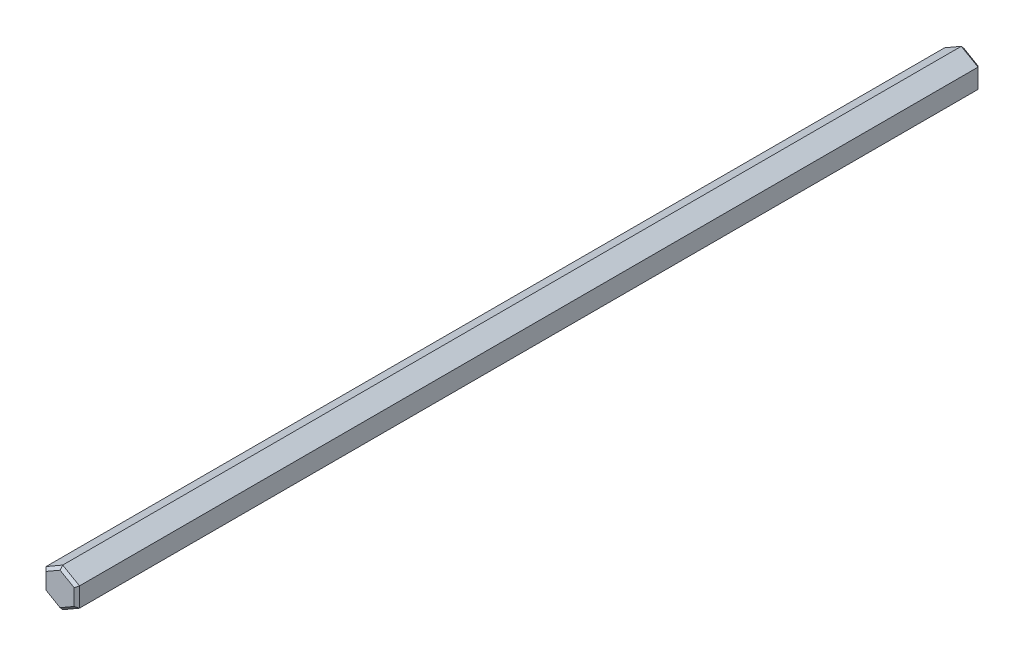
ISO-10303-21;
HEADER;
FILE_DESCRIPTION(('STEP AP214'),'2;1');
FILE_NAME('part.step','',(''),(''),'','','');
FILE_SCHEMA(('AUTOMOTIVE_DESIGN { 1 0 10303 214 1 1 1 1 }'));
ENDSEC;
DATA;
#1=APPLICATION_CONTEXT('core data for automotive mechanical design processes');
#2=APPLICATION_PROTOCOL_DEFINITION('international standard','automotive_design',2000,#1);
#3=PRODUCT_CONTEXT('',#1,'mechanical');
#4=PRODUCT('Part','Part','',(#3));
#5=PRODUCT_RELATED_PRODUCT_CATEGORY('part','',(#4));
#6=PRODUCT_DEFINITION_FORMATION('','',#4);
#7=PRODUCT_DEFINITION_CONTEXT('part definition',#1,'design');
#8=PRODUCT_DEFINITION('design','',#6,#7);
#9=PRODUCT_DEFINITION_SHAPE('','',#8);
#10=(LENGTH_UNIT() NAMED_UNIT(*) SI_UNIT(.MILLI.,.METRE.));
#11=(NAMED_UNIT(*) PLANE_ANGLE_UNIT() SI_UNIT($,.RADIAN.));
#12=(NAMED_UNIT(*) SI_UNIT($,.STERADIAN.) SOLID_ANGLE_UNIT());
#13=UNCERTAINTY_MEASURE_WITH_UNIT(LENGTH_MEASURE(1.E-05),#10,'distance_accuracy_value','');
#14=(GEOMETRIC_REPRESENTATION_CONTEXT(3) GLOBAL_UNCERTAINTY_ASSIGNED_CONTEXT((#13)) GLOBAL_UNIT_ASSIGNED_CONTEXT((#10,
#11,#12)) REPRESENTATION_CONTEXT('',''));
#15=CARTESIAN_POINT('',(0.,0.,0.));
#16=DIRECTION('',(0.,0.,1.));
#17=DIRECTION('',(1.,0.,0.));
#18=AXIS2_PLACEMENT_3D('',#15,#16,#17);
#19=CARTESIAN_POINT('',(-1.775,-1.63101451046069,67.3));
#20=DIRECTION('',(-0.353553390593274,-0.612372435695795,0.707106781186547));
#21=DIRECTION('',(0.,-0.755928946018454,-0.654653670707978));
#22=AXIS2_PLACEMENT_3D('',#19,#20,#21);
#23=PLANE('',#22);
#24=DIRECTION('',(0.866025403784438,-0.5,0.));
#25=VECTOR('',#24,1.);
#26=CARTESIAN_POINT('',(-2.1,-1.21243556529822,67.5));
#27=LINE('',#26,#25);
#28=CARTESIAN_POINT('',(-2.10000000000001,-1.21243556529822,67.5));
#29=VERTEX_POINT('',#28);
#30=CARTESIAN_POINT('',(0.,-2.42487113059644,67.5));
#31=VERTEX_POINT('',#30);
#32=EDGE_CURVE('E120',#29,#31,#27,.T.);
#33=ORIENTED_EDGE('',*,*,#32,.F.);
#34=DIRECTION('',(0.654653670707977,0.37796447300923,0.654653670707976));
#35=VECTOR('',#34,1.);
#36=CARTESIAN_POINT('',(-2.5,-1.44337567297407,67.1));
#37=LINE('',#36,#35);
#38=CARTESIAN_POINT('',(-2.5,-1.44337567297407,67.1));
#39=VERTEX_POINT('',#38);
#40=EDGE_CURVE('E108',#39,#29,#37,.T.);
#41=ORIENTED_EDGE('',*,*,#40,.F.);
#42=DIRECTION('',(0.866025403784439,-0.5,0.));
#43=VECTOR('',#42,1.);
#44=CARTESIAN_POINT('',(-2.5,-1.44337567297406,67.1));
#45=LINE('',#44,#43);
#46=CARTESIAN_POINT('',(0.,-2.88675134594812,67.1));
#47=VERTEX_POINT('',#46);
#48=EDGE_CURVE('E131',#47,#39,#45,.F.);
#49=ORIENTED_EDGE('',*,*,#48,.F.);
#50=DIRECTION('',(0.,-0.755928946018454,-0.654653670707978));
#51=VECTOR('',#50,1.);
#52=CARTESIAN_POINT('',(0.,-2.48260615751539,67.45));
#53=LINE('',#52,#51);
#54=EDGE_CURVE('E20',#31,#47,#53,.T.);
#55=ORIENTED_EDGE('',*,*,#54,.F.);
#56=EDGE_LOOP('',(#33,#41,#49,#55));
#57=FACE_BOUND('',#56,.T.);
#58=ADVANCED_FACE('F17',(#57),#23,.T.);
#59=CARTESIAN_POINT('',(0.524999999999999,-2.35270234694773,67.3));
#60=DIRECTION('',(0.353553390593274,-0.612372435695795,0.707106781186547));
#61=DIRECTION('',(0.,-0.755928946018454,-0.654653670707978));
#62=AXIS2_PLACEMENT_3D('',#59,#60,#61);
#63=PLANE('',#62);
#64=DIRECTION('',(0.866025403784439,0.5,0.));
#65=VECTOR('',#64,1.);
#66=CARTESIAN_POINT('',(0.,-2.88675134594813,67.1));
#67=LINE('',#66,#65);
#68=CARTESIAN_POINT('',(2.5,-1.44337567297407,67.1));
#69=VERTEX_POINT('',#68);
#70=EDGE_CURVE('E146',#69,#47,#67,.F.);
#71=ORIENTED_EDGE('',*,*,#70,.F.);
#72=DIRECTION('',(0.654653670707976,-0.377964473009231,-0.654653670707976));
#73=VECTOR('',#72,1.);
#74=CARTESIAN_POINT('',(2.10000000000001,-1.21243556529822,67.5));
#75=LINE('',#74,#73);
#76=CARTESIAN_POINT('',(2.1,-1.21243556529822,67.5));
#77=VERTEX_POINT('',#76);
#78=EDGE_CURVE('E163',#77,#69,#75,.T.);
#79=ORIENTED_EDGE('',*,*,#78,.F.);
#80=DIRECTION('',(0.866025403784439,0.5,0.));
#81=VECTOR('',#80,1.);
#82=CARTESIAN_POINT('',(0.,-2.42487113059643,67.5));
#83=LINE('',#82,#81);
#84=EDGE_CURVE('E122',#31,#77,#83,.T.);
#85=ORIENTED_EDGE('',*,*,#84,.F.);
#86=ORIENTED_EDGE('',*,*,#54,.T.);
#87=EDGE_LOOP('',(#71,#79,#85,#86));
#88=FACE_BOUND('',#87,.T.);
#89=ADVANCED_FACE('F143',(#88),#63,.T.);
#90=CARTESIAN_POINT('',(-1.775,-1.63101451046069,-67.3));
#91=DIRECTION('',(-0.353553390593274,-0.612372435695795,-0.707106781186547));
#92=DIRECTION('',(0.,0.755928946018454,-0.654653670707978));
#93=AXIS2_PLACEMENT_3D('',#90,#91,#92);
#94=PLANE('',#93);
#95=DIRECTION('',(0.866025403784439,-0.5,0.));
#96=VECTOR('',#95,1.);
#97=CARTESIAN_POINT('',(-2.1,-1.21243556529822,-67.5));
#98=LINE('',#97,#96);
#99=CARTESIAN_POINT('',(-2.10000000000001,-1.21243556529822,-67.5));
#100=VERTEX_POINT('',#99);
#101=CARTESIAN_POINT('',(0.,-2.42487113059644,-67.5));
#102=VERTEX_POINT('',#101);
#103=EDGE_CURVE('E208',#100,#102,#98,.T.);
#104=ORIENTED_EDGE('',*,*,#103,.T.);
#105=DIRECTION('',(0.,0.755928946018454,-0.654653670707978));
#106=VECTOR('',#105,1.);
#107=CARTESIAN_POINT('',(0.,-2.48260615751539,-67.45));
#108=LINE('',#107,#106);
#109=CARTESIAN_POINT('',(0.,-2.88675134594812,-67.1));
#110=VERTEX_POINT('',#109);
#111=EDGE_CURVE('E117',#110,#102,#108,.T.);
#112=ORIENTED_EDGE('',*,*,#111,.F.);
#113=DIRECTION('',(0.866025403784439,-0.5,0.));
#114=VECTOR('',#113,1.);
#115=CARTESIAN_POINT('',(-2.5,-1.44337567297406,-67.1));
#116=LINE('',#115,#114);
#117=CARTESIAN_POINT('',(-2.5,-1.44337567297407,-67.1));
#118=VERTEX_POINT('',#117);
#119=EDGE_CURVE('E128',#118,#110,#116,.T.);
#120=ORIENTED_EDGE('',*,*,#119,.F.);
#121=DIRECTION('',(-0.654653670707977,-0.37796447300923,0.654653670707976));
#122=VECTOR('',#121,1.);
#123=CARTESIAN_POINT('',(-2.10000000000001,-1.21243556529822,-67.5));
#124=LINE('',#123,#122);
#125=EDGE_CURVE('E116',#100,#118,#124,.T.);
#126=ORIENTED_EDGE('',*,*,#125,.F.);
#127=EDGE_LOOP('',(#104,#112,#120,#126));
#128=FACE_BOUND('',#127,.T.);
#129=ADVANCED_FACE('F270',(#128),#94,.T.);
#130=CARTESIAN_POINT('',(0.524999999999999,-2.35270234694773,-67.3));
#131=DIRECTION('',(0.353553390593274,-0.612372435695795,-0.707106781186547));
#132=DIRECTION('',(0.,0.755928946018454,-0.654653670707978));
#133=AXIS2_PLACEMENT_3D('',#130,#131,#132);
#134=PLANE('',#133);
#135=DIRECTION('',(0.866025403784439,0.5,0.));
#136=VECTOR('',#135,1.);
#137=CARTESIAN_POINT('',(0.,-2.42487113059643,-67.5));
#138=LINE('',#137,#136);
#139=CARTESIAN_POINT('',(2.1,-1.21243556529822,-67.5));
#140=VERTEX_POINT('',#139);
#141=EDGE_CURVE('E206',#102,#140,#138,.T.);
#142=ORIENTED_EDGE('',*,*,#141,.T.);
#143=DIRECTION('',(-0.654653670707976,0.377964473009241,-0.65465367070797));
#144=VECTOR('',#143,1.);
#145=CARTESIAN_POINT('',(2.49999999999999,-1.44337567297407,-67.1));
#146=LINE('',#145,#144);
#147=CARTESIAN_POINT('',(2.5,-1.44337567297406,-67.1));
#148=VERTEX_POINT('',#147);
#149=EDGE_CURVE('E215',#148,#140,#146,.T.);
#150=ORIENTED_EDGE('',*,*,#149,.F.);
#151=DIRECTION('',(0.866025403784439,0.5,0.));
#152=VECTOR('',#151,1.);
#153=CARTESIAN_POINT('',(0.,-2.88675134594813,-67.1));
#154=LINE('',#153,#152);
#155=EDGE_CURVE('E156',#110,#148,#154,.T.);
#156=ORIENTED_EDGE('',*,*,#155,.F.);
#157=ORIENTED_EDGE('',*,*,#111,.T.);
#158=EDGE_LOOP('',(#142,#150,#156,#157));
#159=FACE_BOUND('',#158,.T.);
#160=ADVANCED_FACE('F272',(#159),#134,.T.);
#161=CARTESIAN_POINT('',(-2.3,0.721687836487032,67.3));
#162=DIRECTION('',(-0.707106781186548,0.,0.707106781186547));
#163=DIRECTION('',(0.707106781186547,0.,0.707106781186548));
#164=AXIS2_PLACEMENT_3D('',#161,#162,#163);
#165=PLANE('',#164);
#166=DIRECTION('',(0.,1.,0.));
#167=VECTOR('',#166,1.);
#168=CARTESIAN_POINT('',(-2.1,0.,67.5));
#169=LINE('',#168,#167);
#170=CARTESIAN_POINT('',(-2.10000000000001,1.21243556529822,67.5));
#171=VERTEX_POINT('',#170);
#172=EDGE_CURVE('E111',#171,#29,#169,.F.);
#173=ORIENTED_EDGE('',*,*,#172,.F.);
#174=DIRECTION('',(0.65465367070798,-0.377964473009224,0.654653670707976));
#175=VECTOR('',#174,1.);
#176=CARTESIAN_POINT('',(-2.50000000000001,1.44337567297407,67.1));
#177=LINE('',#176,#175);
#178=CARTESIAN_POINT('',(-2.5,1.44337567297407,67.1));
#179=VERTEX_POINT('',#178);
#180=EDGE_CURVE('E201',#179,#171,#177,.T.);
#181=ORIENTED_EDGE('',*,*,#180,.F.);
#182=DIRECTION('',(0.,1.,0.));
#183=VECTOR('',#182,1.);
#184=CARTESIAN_POINT('',(-2.5,1.44337567297406,67.1));
#185=LINE('',#184,#183);
#186=EDGE_CURVE('E114',#39,#179,#185,.T.);
#187=ORIENTED_EDGE('',*,*,#186,.F.);
#188=ORIENTED_EDGE('',*,*,#40,.T.);
#189=EDGE_LOOP('',(#173,#181,#187,#188));
#190=FACE_BOUND('',#189,.T.);
#191=ADVANCED_FACE('F109',(#190),#165,.T.);
#192=CARTESIAN_POINT('',(-2.3,0.721687836487032,-67.3));
#193=DIRECTION('',(-0.707106781186548,0.,-0.707106781186547));
#194=DIRECTION('',(-0.707106781186547,0.,0.707106781186548));
#195=AXIS2_PLACEMENT_3D('',#192,#193,#194);
#196=PLANE('',#195);
#197=DIRECTION('',(0.,1.,0.));
#198=VECTOR('',#197,1.);
#199=CARTESIAN_POINT('',(-2.1,0.,-67.5));
#200=LINE('',#199,#198);
#201=CARTESIAN_POINT('',(-2.1,1.21243556529822,-67.5));
#202=VERTEX_POINT('',#201);
#203=EDGE_CURVE('E210',#202,#100,#200,.F.);
#204=ORIENTED_EDGE('',*,*,#203,.T.);
#205=ORIENTED_EDGE('',*,*,#125,.T.);
#206=DIRECTION('',(0.,1.,0.));
#207=VECTOR('',#206,1.);
#208=CARTESIAN_POINT('',(-2.5,1.44337567297406,-67.1));
#209=LINE('',#208,#207);
#210=CARTESIAN_POINT('',(-2.5,1.44337567297407,-67.1));
#211=VERTEX_POINT('',#210);
#212=EDGE_CURVE('E191',#211,#118,#209,.F.);
#213=ORIENTED_EDGE('',*,*,#212,.F.);
#214=DIRECTION('',(-0.654653670707989,0.37796447300922,0.65465367070797));
#215=VECTOR('',#214,1.);
#216=CARTESIAN_POINT('',(-2.10000000000001,1.21243556529822,-67.5));
#217=LINE('',#216,#215);
#218=EDGE_CURVE('E195',#202,#211,#217,.T.);
#219=ORIENTED_EDGE('',*,*,#218,.F.);
#220=EDGE_LOOP('',(#204,#205,#213,#219));
#221=FACE_BOUND('',#220,.T.);
#222=ADVANCED_FACE('F264',(#221),#196,.T.);
#223=CARTESIAN_POINT('',(-2.5,-1.44337567297406,0.));
#224=DIRECTION('',(-0.5,-0.866025403784439,0.));
#225=DIRECTION('',(0.866025403784439,-0.5,0.));
#226=AXIS2_PLACEMENT_3D('',#223,#224,#225);
#227=PLANE('',#226);
#228=ORIENTED_EDGE('',*,*,#119,.T.);
#229=DIRECTION('',(0.,0.,1.));
#230=VECTOR('',#229,1.);
#231=CARTESIAN_POINT('',(0.,-2.88675134594813,0.));
#232=LINE('',#231,#230);
#233=EDGE_CURVE('E150',#47,#110,#232,.F.);
#234=ORIENTED_EDGE('',*,*,#233,.F.);
#235=ORIENTED_EDGE('',*,*,#48,.T.);
#236=DIRECTION('',(0.,0.,1.));
#237=VECTOR('',#236,1.);
#238=CARTESIAN_POINT('',(-2.5,-1.44337567297407,0.));
#239=LINE('',#238,#237);
#240=EDGE_CURVE('E186',#118,#39,#239,.T.);
#241=ORIENTED_EDGE('',*,*,#240,.F.);
#242=EDGE_LOOP('',(#228,#234,#235,#241));
#243=FACE_BOUND('',#242,.T.);
#244=ADVANCED_FACE('F151',(#243),#227,.T.);
#245=CARTESIAN_POINT('',(0.,0.,67.5));
#246=DIRECTION('',(0.,0.,1.));
#247=DIRECTION('',(1.,0.,0.));
#248=AXIS2_PLACEMENT_3D('',#245,#246,#247);
#249=PLANE('',#248);
#250=DIRECTION('',(0.,1.,0.));
#251=VECTOR('',#250,1.);
#252=CARTESIAN_POINT('',(2.10000000000001,-0.721687836487033,67.5));
#253=LINE('',#252,#251);
#254=CARTESIAN_POINT('',(2.1,1.21243556529822,67.5));
#255=VERTEX_POINT('',#254);
#256=EDGE_CURVE('E165',#255,#77,#253,.F.);
#257=ORIENTED_EDGE('',*,*,#256,.F.);
#258=DIRECTION('',(0.866025403784439,-0.5,0.));
#259=VECTOR('',#258,1.);
#260=CARTESIAN_POINT('',(0.,2.42487113059644,67.5));
#261=LINE('',#260,#259);
#262=CARTESIAN_POINT('',(0.,2.42487113059644,67.5));
#263=VERTEX_POINT('',#262);
#264=EDGE_CURVE('E180',#263,#255,#261,.T.);
#265=ORIENTED_EDGE('',*,*,#264,.F.);
#266=DIRECTION('',(0.866025403784439,0.5,0.));
#267=VECTOR('',#266,1.);
#268=CARTESIAN_POINT('',(-2.10000000000001,1.21243556529822,67.5));
#269=LINE('',#268,#267);
#270=EDGE_CURVE('E126',#171,#263,#269,.T.);
#271=ORIENTED_EDGE('',*,*,#270,.F.);
#272=ORIENTED_EDGE('',*,*,#172,.T.);
#273=ORIENTED_EDGE('',*,*,#32,.T.);
#274=ORIENTED_EDGE('',*,*,#84,.T.);
#275=EDGE_LOOP('',(#257,#265,#271,#272,#273,#274));
#276=FACE_BOUND('',#275,.T.);
#277=ADVANCED_FACE('F124',(#276),#249,.T.);
#278=CARTESIAN_POINT('',(2.3,-0.721687836487033,67.3));
#279=DIRECTION('',(0.707106781186548,0.,0.707106781186547));
#280=DIRECTION('',(0.707106781186547,0.,-0.707106781186548));
#281=AXIS2_PLACEMENT_3D('',#278,#279,#280);
#282=PLANE('',#281);
#283=DIRECTION('',(0.,1.,0.));
#284=VECTOR('',#283,1.);
#285=CARTESIAN_POINT('',(2.5,-1.44337567297406,67.1));
#286=LINE('',#285,#284);
#287=CARTESIAN_POINT('',(2.5,1.44337567297406,67.1));
#288=VERTEX_POINT('',#287);
#289=EDGE_CURVE('E176',#288,#69,#286,.F.);
#290=ORIENTED_EDGE('',*,*,#289,.F.);
#291=DIRECTION('',(0.654653670707981,0.377964473009224,-0.654653670707975));
#292=VECTOR('',#291,1.);
#293=CARTESIAN_POINT('',(2.1,1.21243556529822,67.5));
#294=LINE('',#293,#292);
#295=EDGE_CURVE('E174',#255,#288,#294,.T.);
#296=ORIENTED_EDGE('',*,*,#295,.F.);
#297=ORIENTED_EDGE('',*,*,#256,.T.);
#298=ORIENTED_EDGE('',*,*,#78,.T.);
#299=EDGE_LOOP('',(#290,#296,#297,#298));
#300=FACE_BOUND('',#299,.T.);
#301=ADVANCED_FACE('F172',(#300),#282,.T.);
#302=CARTESIAN_POINT('',(0.,-2.88675134594813,0.));
#303=DIRECTION('',(0.5,-0.866025403784439,0.));
#304=DIRECTION('',(0.866025403784439,0.5,0.));
#305=AXIS2_PLACEMENT_3D('',#302,#303,#304);
#306=PLANE('',#305);
#307=ORIENTED_EDGE('',*,*,#155,.T.);
#308=DIRECTION('',(0.,0.,-1.));
#309=VECTOR('',#308,1.);
#310=CARTESIAN_POINT('',(2.5,-1.44337567297407,0.));
#311=LINE('',#310,#309);
#312=EDGE_CURVE('E161',#69,#148,#311,.T.);
#313=ORIENTED_EDGE('',*,*,#312,.F.);
#314=ORIENTED_EDGE('',*,*,#70,.T.);
#315=ORIENTED_EDGE('',*,*,#233,.T.);
#316=EDGE_LOOP('',(#307,#313,#314,#315));
#317=FACE_BOUND('',#316,.T.);
#318=ADVANCED_FACE('F159',(#317),#306,.T.);
#319=CARTESIAN_POINT('',(2.3,-0.721687836487033,-67.3));
#320=DIRECTION('',(0.707106781186548,0.,-0.707106781186547));
#321=DIRECTION('',(-0.707106781186547,0.,-0.707106781186548));
#322=AXIS2_PLACEMENT_3D('',#319,#320,#321);
#323=PLANE('',#322);
#324=DIRECTION('',(0.,1.,0.));
#325=VECTOR('',#324,1.);
#326=CARTESIAN_POINT('',(2.1,0.,-67.5));
#327=LINE('',#326,#325);
#328=CARTESIAN_POINT('',(2.1,1.21243556529822,-67.5));
#329=VERTEX_POINT('',#328);
#330=EDGE_CURVE('E203',#140,#329,#327,.T.);
#331=ORIENTED_EDGE('',*,*,#330,.T.);
#332=DIRECTION('',(0.654653670707977,0.377964473009228,0.654653670707977));
#333=VECTOR('',#332,1.);
#334=CARTESIAN_POINT('',(2.10000000000001,1.21243556529821,-67.5));
#335=LINE('',#334,#333);
#336=CARTESIAN_POINT('',(2.5,1.44337567297406,-67.1));
#337=VERTEX_POINT('',#336);
#338=EDGE_CURVE('E213',#329,#337,#335,.T.);
#339=ORIENTED_EDGE('',*,*,#338,.T.);
#340=DIRECTION('',(0.,1.,0.));
#341=VECTOR('',#340,1.);
#342=CARTESIAN_POINT('',(2.5,-1.44337567297406,-67.1));
#343=LINE('',#342,#341);
#344=EDGE_CURVE('E220',#148,#337,#343,.T.);
#345=ORIENTED_EDGE('',*,*,#344,.F.);
#346=ORIENTED_EDGE('',*,*,#149,.T.);
#347=EDGE_LOOP('',(#331,#339,#345,#346));
#348=FACE_BOUND('',#347,.T.);
#349=ADVANCED_FACE('F221',(#348),#323,.T.);
#350=CARTESIAN_POINT('',(0.,0.,-67.5));
#351=DIRECTION('',(0.,0.,1.));
#352=DIRECTION('',(1.,0.,0.));
#353=AXIS2_PLACEMENT_3D('',#350,#351,#352);
#354=PLANE('',#353);
#355=DIRECTION('',(-0.866025403784439,0.5,0.));
#356=VECTOR('',#355,1.);
#357=CARTESIAN_POINT('',(2.10000000000001,1.21243556529822,-67.5));
#358=LINE('',#357,#356);
#359=CARTESIAN_POINT('',(0.,2.42487113059643,-67.5));
#360=VERTEX_POINT('',#359);
#361=EDGE_CURVE('E225',#329,#360,#358,.T.);
#362=ORIENTED_EDGE('',*,*,#361,.F.);
#363=ORIENTED_EDGE('',*,*,#330,.F.);
#364=ORIENTED_EDGE('',*,*,#141,.F.);
#365=ORIENTED_EDGE('',*,*,#103,.F.);
#366=ORIENTED_EDGE('',*,*,#203,.F.);
#367=DIRECTION('',(-0.866025403784439,-0.5,0.));
#368=VECTOR('',#367,1.);
#369=CARTESIAN_POINT('',(0.,2.42487113059643,-67.5));
#370=LINE('',#369,#368);
#371=EDGE_CURVE('E197',#360,#202,#370,.T.);
#372=ORIENTED_EDGE('',*,*,#371,.F.);
#373=EDGE_LOOP('',(#362,#363,#364,#365,#366,#372));
#374=FACE_BOUND('',#373,.T.);
#375=ADVANCED_FACE('F267',(#374),#354,.F.);
#376=CARTESIAN_POINT('',(-0.525000000000001,2.35270234694773,67.3));
#377=DIRECTION('',(-0.353553390593274,0.612372435695795,0.707106781186547));
#378=DIRECTION('',(0.,-0.755928946018454,0.654653670707978));
#379=AXIS2_PLACEMENT_3D('',#376,#377,#378);
#380=PLANE('',#379);
#381=ORIENTED_EDGE('',*,*,#270,.T.);
#382=DIRECTION('',(0.,-0.755928946018454,0.654653670707978));
#383=VECTOR('',#382,1.);
#384=CARTESIAN_POINT('',(0.,2.07021310809423,67.8071428571429));
#385=LINE('',#384,#383);
#386=CARTESIAN_POINT('',(0.,2.88675134594812,67.1));
#387=VERTEX_POINT('',#386);
#388=EDGE_CURVE('E184',#387,#263,#385,.T.);
#389=ORIENTED_EDGE('',*,*,#388,.F.);
#390=DIRECTION('',(-0.866025403784439,-0.5,0.));
#391=VECTOR('',#390,1.);
#392=CARTESIAN_POINT('',(0.,2.88675134594813,67.1));
#393=LINE('',#392,#391);
#394=EDGE_CURVE('E234',#179,#387,#393,.F.);
#395=ORIENTED_EDGE('',*,*,#394,.F.);
#396=ORIENTED_EDGE('',*,*,#180,.T.);
#397=EDGE_LOOP('',(#381,#389,#395,#396));
#398=FACE_BOUND('',#397,.T.);
#399=ADVANCED_FACE('F259',(#398),#380,.T.);
#400=CARTESIAN_POINT('',(-0.525000000000001,2.35270234694773,-67.3));
#401=DIRECTION('',(-0.353553390593274,0.612372435695795,-0.707106781186547));
#402=DIRECTION('',(0.,0.755928946018454,0.654653670707978));
#403=AXIS2_PLACEMENT_3D('',#400,#401,#402);
#404=PLANE('',#403);
#405=DIRECTION('',(-0.866025403784439,-0.5,0.));
#406=VECTOR('',#405,1.);
#407=CARTESIAN_POINT('',(0.,2.88675134594813,-67.1));
#408=LINE('',#407,#406);
#409=CARTESIAN_POINT('',(0.,2.88675134594812,-67.1));
#410=VERTEX_POINT('',#409);
#411=EDGE_CURVE('E35',#410,#211,#408,.T.);
#412=ORIENTED_EDGE('',*,*,#411,.F.);
#413=DIRECTION('',(0.,0.755928946018454,0.654653670707978));
#414=VECTOR('',#413,1.);
#415=CARTESIAN_POINT('',(0.,2.07021310809423,-67.8071428571429));
#416=LINE('',#415,#414);
#417=EDGE_CURVE('E232',#360,#410,#416,.T.);
#418=ORIENTED_EDGE('',*,*,#417,.F.);
#419=ORIENTED_EDGE('',*,*,#371,.T.);
#420=ORIENTED_EDGE('',*,*,#218,.T.);
#421=EDGE_LOOP('',(#412,#418,#419,#420));
#422=FACE_BOUND('',#421,.T.);
#423=ADVANCED_FACE('F265',(#422),#404,.T.);
#424=CARTESIAN_POINT('',(-2.5,1.44337567297406,0.));
#425=DIRECTION('',(-1.,0.,0.));
#426=DIRECTION('',(0.,0.,1.));
#427=AXIS2_PLACEMENT_3D('',#424,#425,#426);
#428=PLANE('',#427);
#429=ORIENTED_EDGE('',*,*,#212,.T.);
#430=ORIENTED_EDGE('',*,*,#240,.T.);
#431=ORIENTED_EDGE('',*,*,#186,.T.);
#432=DIRECTION('',(0.,0.,1.));
#433=VECTOR('',#432,1.);
#434=CARTESIAN_POINT('',(-2.5,1.44337567297406,0.));
#435=LINE('',#434,#433);
#436=EDGE_CURVE('E238',#211,#179,#435,.T.);
#437=ORIENTED_EDGE('',*,*,#436,.F.);
#438=EDGE_LOOP('',(#429,#430,#431,#437));
#439=FACE_BOUND('',#438,.T.);
#440=ADVANCED_FACE('F261',(#439),#428,.T.);
#441=CARTESIAN_POINT('',(1.775,1.63101451046069,67.3));
#442=DIRECTION('',(0.353553390593274,0.612372435695795,0.707106781186547));
#443=DIRECTION('',(0.,-0.755928946018454,0.654653670707978));
#444=AXIS2_PLACEMENT_3D('',#441,#442,#443);
#445=PLANE('',#444);
#446=ORIENTED_EDGE('',*,*,#264,.T.);
#447=ORIENTED_EDGE('',*,*,#295,.T.);
#448=DIRECTION('',(-0.866025403784439,0.5,0.));
#449=VECTOR('',#448,1.);
#450=CARTESIAN_POINT('',(2.5,1.44337567297406,67.1));
#451=LINE('',#450,#449);
#452=EDGE_CURVE('E241',#387,#288,#451,.F.);
#453=ORIENTED_EDGE('',*,*,#452,.F.);
#454=ORIENTED_EDGE('',*,*,#388,.T.);
#455=EDGE_LOOP('',(#446,#447,#453,#454));
#456=FACE_BOUND('',#455,.T.);
#457=ADVANCED_FACE('F183',(#456),#445,.T.);
#458=CARTESIAN_POINT('',(2.5,-1.44337567297406,0.));
#459=DIRECTION('',(1.,0.,0.));
#460=DIRECTION('',(0.,0.,-1.));
#461=AXIS2_PLACEMENT_3D('',#458,#459,#460);
#462=PLANE('',#461);
#463=ORIENTED_EDGE('',*,*,#344,.T.);
#464=DIRECTION('',(0.,0.,1.));
#465=VECTOR('',#464,1.);
#466=CARTESIAN_POINT('',(2.5,1.44337567297406,0.));
#467=LINE('',#466,#465);
#468=EDGE_CURVE('E244',#288,#337,#467,.F.);
#469=ORIENTED_EDGE('',*,*,#468,.F.);
#470=ORIENTED_EDGE('',*,*,#289,.T.);
#471=ORIENTED_EDGE('',*,*,#312,.T.);
#472=EDGE_LOOP('',(#463,#469,#470,#471));
#473=FACE_BOUND('',#472,.T.);
#474=ADVANCED_FACE('F227',(#473),#462,.T.);
#475=CARTESIAN_POINT('',(1.775,1.63101451046069,-67.3));
#476=DIRECTION('',(0.353553390593274,0.612372435695795,-0.707106781186547));
#477=DIRECTION('',(0.,0.755928946018454,0.654653670707978));
#478=AXIS2_PLACEMENT_3D('',#475,#476,#477);
#479=PLANE('',#478);
#480=DIRECTION('',(-0.866025403784439,0.5,0.));
#481=VECTOR('',#480,1.);
#482=CARTESIAN_POINT('',(2.5,1.44337567297406,-67.1));
#483=LINE('',#482,#481);
#484=EDGE_CURVE('E26',#337,#410,#483,.T.);
#485=ORIENTED_EDGE('',*,*,#484,.F.);
#486=ORIENTED_EDGE('',*,*,#338,.F.);
#487=ORIENTED_EDGE('',*,*,#361,.T.);
#488=ORIENTED_EDGE('',*,*,#417,.T.);
#489=EDGE_LOOP('',(#485,#486,#487,#488));
#490=FACE_BOUND('',#489,.T.);
#491=ADVANCED_FACE('F252',(#490),#479,.T.);
#492=CARTESIAN_POINT('',(0.,2.88675134594813,0.));
#493=DIRECTION('',(-0.5,0.866025403784439,0.));
#494=DIRECTION('',(-0.866025403784439,-0.5,0.));
#495=AXIS2_PLACEMENT_3D('',#492,#493,#494);
#496=PLANE('',#495);
#497=ORIENTED_EDGE('',*,*,#411,.T.);
#498=ORIENTED_EDGE('',*,*,#436,.T.);
#499=ORIENTED_EDGE('',*,*,#394,.T.);
#500=DIRECTION('',(0.,0.,1.));
#501=VECTOR('',#500,1.);
#502=CARTESIAN_POINT('',(0.,2.88675134594813,0.));
#503=LINE('',#502,#501);
#504=EDGE_CURVE('E10',#410,#387,#503,.T.);
#505=ORIENTED_EDGE('',*,*,#504,.F.);
#506=EDGE_LOOP('',(#497,#498,#499,#505));
#507=FACE_BOUND('',#506,.T.);
#508=ADVANCED_FACE('F255',(#507),#496,.T.);
#509=CARTESIAN_POINT('',(2.5,1.44337567297406,0.));
#510=DIRECTION('',(0.5,0.866025403784439,0.));
#511=DIRECTION('',(-0.866025403784439,0.5,0.));
#512=AXIS2_PLACEMENT_3D('',#509,#510,#511);
#513=PLANE('',#512);
#514=ORIENTED_EDGE('',*,*,#484,.T.);
#515=ORIENTED_EDGE('',*,*,#504,.T.);
#516=ORIENTED_EDGE('',*,*,#452,.T.);
#517=ORIENTED_EDGE('',*,*,#468,.T.);
#518=EDGE_LOOP('',(#514,#515,#516,#517));
#519=FACE_BOUND('',#518,.T.);
#520=ADVANCED_FACE('F249',(#519),#513,.T.);
#521=CLOSED_SHELL('',(#58,#89,#129,#160,#191,#222,#244,#277,#301,#318,#349,#375,#399,#423,#440,
#457,#474,#491,#508,#520));
#522=MANIFOLD_SOLID_BREP('B1',#521);
#523=ADVANCED_BREP_SHAPE_REPRESENTATION('',(#18,#522),#14);
#524=SHAPE_DEFINITION_REPRESENTATION(#9,#523);
ENDSEC;
END-ISO-10303-21;
